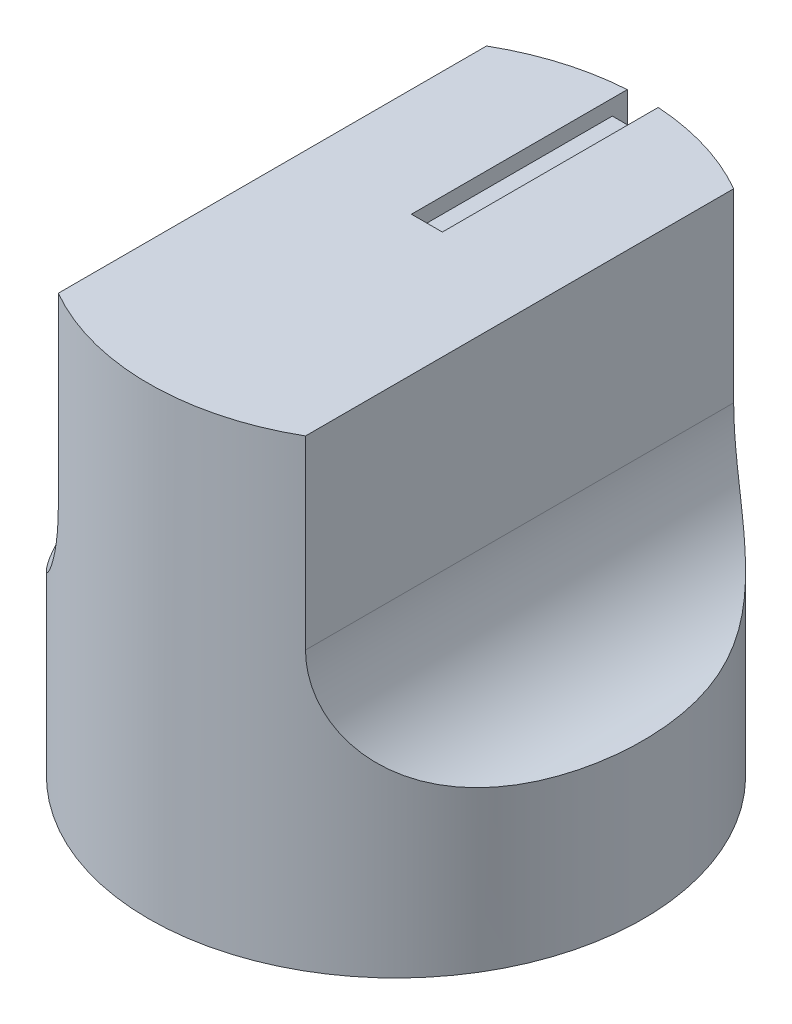
ISO-10303-21;
HEADER;
FILE_DESCRIPTION(('STEP AP214'),'2;1');
FILE_NAME('part.step','',(''),(''),'','','');
FILE_SCHEMA(('AUTOMOTIVE_DESIGN { 1 0 10303 214 1 1 1 1 }'));
ENDSEC;
DATA;
#1=APPLICATION_CONTEXT('core data for automotive mechanical design processes');
#2=APPLICATION_PROTOCOL_DEFINITION('international standard','automotive_design',2000,#1);
#3=PRODUCT_CONTEXT('',#1,'mechanical');
#4=PRODUCT('Part','Part','',(#3));
#5=PRODUCT_RELATED_PRODUCT_CATEGORY('part','',(#4));
#6=PRODUCT_DEFINITION_FORMATION('','',#4);
#7=PRODUCT_DEFINITION_CONTEXT('part definition',#1,'design');
#8=PRODUCT_DEFINITION('design','',#6,#7);
#9=PRODUCT_DEFINITION_SHAPE('','',#8);
#10=(LENGTH_UNIT() NAMED_UNIT(*) SI_UNIT(.MILLI.,.METRE.));
#11=(NAMED_UNIT(*) PLANE_ANGLE_UNIT() SI_UNIT($,.RADIAN.));
#12=(NAMED_UNIT(*) SI_UNIT($,.STERADIAN.) SOLID_ANGLE_UNIT());
#13=UNCERTAINTY_MEASURE_WITH_UNIT(LENGTH_MEASURE(1.E-05),#10,'distance_accuracy_value','');
#14=(GEOMETRIC_REPRESENTATION_CONTEXT(3) GLOBAL_UNCERTAINTY_ASSIGNED_CONTEXT((#13)) GLOBAL_UNIT_ASSIGNED_CONTEXT((#10,
#11,#12)) REPRESENTATION_CONTEXT('',''));
#15=CARTESIAN_POINT('',(0.,0.,0.));
#16=DIRECTION('',(0.,0.,1.));
#17=DIRECTION('',(1.,0.,0.));
#18=AXIS2_PLACEMENT_3D('',#15,#16,#17);
#19=CARTESIAN_POINT('',(0.,3.,0.));
#20=DIRECTION('',(0.,-1.,0.));
#21=DIRECTION('',(0.,0.,-1.));
#22=AXIS2_PLACEMENT_3D('',#19,#20,#21);
#23=CYLINDRICAL_SURFACE('',#22,6.45);
#24=CARTESIAN_POINT('',(0.,3.,0.));
#25=DIRECTION('',(0.,-1.,0.));
#26=DIRECTION('',(0.,0.,-1.));
#27=AXIS2_PLACEMENT_3D('',#24,#25,#26);
#28=CIRCLE('',#27,6.45);
#29=CARTESIAN_POINT('',(0.,3.,-6.45));
#30=VERTEX_POINT('',#29);
#31=EDGE_CURVE('E11',#30,#30,#28,.T.);
#32=ORIENTED_EDGE('',*,*,#31,.T.);
#33=EDGE_LOOP('',(#32));
#34=FACE_BOUND('',#33,.T.);
#35=CARTESIAN_POINT('',(0.,0.,0.));
#36=DIRECTION('',(0.,-1.,0.));
#37=DIRECTION('',(0.,0.,-1.));
#38=AXIS2_PLACEMENT_3D('',#35,#36,#37);
#39=CIRCLE('',#38,6.45);
#40=CARTESIAN_POINT('',(0.,0.,-6.45));
#41=VERTEX_POINT('',#40);
#42=EDGE_CURVE('E44',#41,#41,#39,.T.);
#43=ORIENTED_EDGE('',*,*,#42,.F.);
#44=EDGE_LOOP('',(#43));
#45=FACE_BOUND('',#44,.T.);
#46=ADVANCED_FACE('F41',(#34,#45),#23,.T.);
#47=CARTESIAN_POINT('',(0.,3.,0.));
#48=DIRECTION('',(0.,-1.,0.));
#49=DIRECTION('',(0.,0.,-1.));
#50=AXIS2_PLACEMENT_3D('',#47,#48,#49);
#51=PLANE('',#50);
#52=CARTESIAN_POINT('',(0.,3.,0.));
#53=DIRECTION('',(0.,-1.,0.));
#54=DIRECTION('',(0.,0.,-1.));
#55=AXIS2_PLACEMENT_3D('',#52,#53,#54);
#56=CIRCLE('',#55,3.8);
#57=CARTESIAN_POINT('',(0.,3.,-3.8));
#58=VERTEX_POINT('',#57);
#59=EDGE_CURVE('E51',#58,#58,#56,.T.);
#60=ORIENTED_EDGE('',*,*,#59,.T.);
#61=EDGE_LOOP('',(#60));
#62=FACE_BOUND('',#61,.T.);
#63=ORIENTED_EDGE('',*,*,#31,.F.);
#64=EDGE_LOOP('',(#63));
#65=FACE_BOUND('',#64,.T.);
#66=ADVANCED_FACE('F59',(#62,#65),#51,.F.);
#67=CARTESIAN_POINT('',(0.,0.,0.));
#68=DIRECTION('',(0.,-1.,0.));
#69=DIRECTION('',(0.,0.,-1.));
#70=AXIS2_PLACEMENT_3D('',#67,#68,#69);
#71=PLANE('',#70);
#72=CARTESIAN_POINT('',(0.,0.,0.));
#73=DIRECTION('',(0.,-1.,0.));
#74=DIRECTION('',(0.,0.,-1.));
#75=AXIS2_PLACEMENT_3D('',#72,#73,#74);
#76=CIRCLE('',#75,3.8);
#77=CARTESIAN_POINT('',(0.,0.,-3.8));
#78=VERTEX_POINT('',#77);
#79=EDGE_CURVE('E53',#78,#78,#76,.T.);
#80=ORIENTED_EDGE('',*,*,#79,.F.);
#81=EDGE_LOOP('',(#80));
#82=FACE_BOUND('',#81,.T.);
#83=ORIENTED_EDGE('',*,*,#42,.T.);
#84=EDGE_LOOP('',(#83));
#85=FACE_BOUND('',#84,.T.);
#86=ADVANCED_FACE('F65',(#82,#85),#71,.T.);
#87=CARTESIAN_POINT('',(0.,3.,0.));
#88=DIRECTION('',(0.,-1.,0.));
#89=DIRECTION('',(0.,0.,-1.));
#90=AXIS2_PLACEMENT_3D('',#87,#88,#89);
#91=CYLINDRICAL_SURFACE('',#90,3.8);
#92=ORIENTED_EDGE('',*,*,#59,.F.);
#93=EDGE_LOOP('',(#92));
#94=FACE_BOUND('',#93,.T.);
#95=ORIENTED_EDGE('',*,*,#79,.T.);
#96=EDGE_LOOP('',(#95));
#97=FACE_BOUND('',#96,.T.);
#98=ADVANCED_FACE('F62',(#94,#97),#91,.F.);
#99=CLOSED_SHELL('',(#46,#66,#86,#98));
#100=MANIFOLD_SOLID_BREP('B2',#99);
#101=CARTESIAN_POINT('',(0.,15.,0.));
#102=DIRECTION('',(0.,-1.,0.));
#103=DIRECTION('',(0.,0.,-1.));
#104=AXIS2_PLACEMENT_3D('',#101,#102,#103);
#105=CYLINDRICAL_SURFACE('',#104,8.);
#106=CARTESIAN_POINT('',(0.,0.,0.));
#107=DIRECTION('',(0.,1.,0.));
#108=DIRECTION('',(0.,0.,1.));
#109=AXIS2_PLACEMENT_3D('',#106,#107,#108);
#110=CIRCLE('',#109,8.);
#111=CARTESIAN_POINT('',(-0.5,0.,-7.98435971133565));
#112=VERTEX_POINT('',#111);
#113=CARTESIAN_POINT('',(0.5,0.,-7.98435971133565));
#114=VERTEX_POINT('',#113);
#115=EDGE_CURVE('E250',#112,#114,#110,.T.);
#116=ORIENTED_EDGE('',*,*,#115,.T.);
#117=DIRECTION('',(0.,-1.,0.));
#118=VECTOR('',#117,1.);
#119=CARTESIAN_POINT('',(0.5,15.,-7.98435971133565));
#120=LINE('',#119,#118);
#121=CARTESIAN_POINT('',(0.5,15.,-7.98435971133565));
#122=VERTEX_POINT('',#121);
#123=EDGE_CURVE('E111',#114,#122,#120,.F.);
#124=ORIENTED_EDGE('',*,*,#123,.T.);
#125=CARTESIAN_POINT('',(0.,15.,0.));
#126=DIRECTION('',(0.,1.,0.));
#127=DIRECTION('',(0.,0.,1.));
#128=AXIS2_PLACEMENT_3D('',#125,#126,#127);
#129=CIRCLE('',#128,8.);
#130=CARTESIAN_POINT('',(4.,15.,-6.92820323027551));
#131=VERTEX_POINT('',#130);
#132=EDGE_CURVE('E255',#131,#122,#129,.T.);
#133=ORIENTED_EDGE('',*,*,#132,.F.);
#134=DIRECTION('',(0.,-1.,0.));
#135=VECTOR('',#134,1.);
#136=CARTESIAN_POINT('',(4.,15.,-6.92820323027551));
#137=LINE('',#136,#135);
#138=CARTESIAN_POINT('',(4.,9.,-6.92820323027551));
#139=VERTEX_POINT('',#138);
#140=EDGE_CURVE('E243',#131,#139,#137,.T.);
#141=ORIENTED_EDGE('',*,*,#140,.T.);
#142=CARTESIAN_POINT('',(4.,9.,-6.92820323027551));
#143=CARTESIAN_POINT('',(3.9999835722425,8.90200515013691,-6.92819687410735));
#144=CARTESIAN_POINT('',(4.00360043340264,8.80401188244841,-6.9261240227385));
#145=CARTESIAN_POINT('',(4.01798276798626,8.60873570848839,-6.91779893875372));
#146=CARTESIAN_POINT('',(4.02874781000819,8.51145275970643,-6.91154695835323));
#147=CARTESIAN_POINT('',(4.05728899691143,8.31842478046616,-6.8948286993831));
#148=CARTESIAN_POINT('',(4.07505551335688,8.22267782510478,-6.88436820795136));
#149=CARTESIAN_POINT('',(4.11736554168773,8.03327199832824,-6.85914798190404));
#150=CARTESIAN_POINT('',(4.14190895354734,7.93961309611583,-6.84438831074345));
#151=CARTESIAN_POINT('',(4.19746101487635,7.75501328537845,-6.8104609571265));
#152=CARTESIAN_POINT('',(4.22847203616782,7.66407338800315,-6.79129165729093));
#153=CARTESIAN_POINT('',(4.29654650358197,7.48554906331703,-6.74842986488926));
#154=CARTESIAN_POINT('',(4.33361216584693,7.39796587918973,-6.7247357155819));
#155=CARTESIAN_POINT('',(4.41324580286913,7.22684069241129,-6.6727444832938));
#156=CARTESIAN_POINT('',(4.45580978785766,7.14329581924895,-6.64445073412743));
#157=CARTESIAN_POINT('',(4.54587613481682,6.98067527510326,-6.58315867012874));
#158=CARTESIAN_POINT('',(4.5933803104103,6.90160126200629,-6.55015862587755));
#159=CARTESIAN_POINT('',(4.69290796413624,6.74798783046527,-6.4792254778006));
#160=CARTESIAN_POINT('',(4.74495423874842,6.67347490575537,-6.44126695188476));
#161=CARTESIAN_POINT('',(4.852602391186,6.52978464844852,-6.36056521178928));
#162=CARTESIAN_POINT('',(4.90820553628836,6.46060923713861,-6.31782028814789));
#163=CARTESIAN_POINT('',(5.07916803374714,6.26152367084069,-6.18248162788317));
#164=CARTESIAN_POINT('',(5.19875091452228,6.13994785248332,-6.0827351957496));
#165=CARTESIAN_POINT('',(5.45018821795654,5.91309823520741,-5.8587972011498));
#166=CARTESIAN_POINT('',(5.58234444563209,5.80929448274484,-5.73347656075242));
#167=CARTESIAN_POINT('',(5.84541736244444,5.62605488345185,-5.46501709005642));
#168=CARTESIAN_POINT('',(5.97633345512774,5.54663023729272,-5.32187011200171));
#169=CARTESIAN_POINT('',(6.19989900396769,5.42627315003248,-5.05800022202342));
#170=CARTESIAN_POINT('',(6.29397602939143,5.38067994937706,-4.94053971650036));
#171=CARTESIAN_POINT('',(6.47692504289753,5.29996761174969,-4.69813684152143));
#172=CARTESIAN_POINT('',(6.56579488818492,5.26485276270943,-4.5731914341527));
#173=CARTESIAN_POINT('',(6.7372577248798,5.20344923127442,-4.31662247507116));
#174=CARTESIAN_POINT('',(6.81983688297195,5.17717958940873,-4.18498520999598));
#175=CARTESIAN_POINT('',(6.97767616680622,5.13197837366049,-3.91616493360132));
#176=CARTESIAN_POINT('',(7.05293434827596,5.11304874514201,-3.77898046269936));
#177=CARTESIAN_POINT('',(7.21967322379826,5.07563008091141,-3.45258095752635));
#178=CARTESIAN_POINT('',(7.30800946701544,5.0594639629425,-3.26148721369789));
#179=CARTESIAN_POINT('',(7.46948016307689,5.03449604217453,-2.87250009121431));
#180=CARTESIAN_POINT('',(7.54260970618666,5.02569661506718,-2.6746045404403));
#181=CARTESIAN_POINT('',(7.67304641667369,5.01284593772434,-2.27350709522336));
#182=CARTESIAN_POINT('',(7.73035210338644,5.0087951317102,-2.07030470615671));
#183=CARTESIAN_POINT('',(7.8287230023349,5.00336503278157,-1.66000115984097));
#184=CARTESIAN_POINT('',(7.86978974461307,5.00198548813159,-1.45290037182838));
#185=CARTESIAN_POINT('',(7.93589866811422,5.00037465285776,-1.0331050430258));
#186=CARTESIAN_POINT('',(7.96070244115308,5.00016012370093,-0.82037287857853));
#187=CARTESIAN_POINT('',(7.99317690069333,4.99997282201595,-0.393601563439323));
#188=CARTESIAN_POINT('',(8.00084723416683,5.00000005446914,-0.179562385908006));
#189=CARTESIAN_POINT('',(7.99900409932795,4.99999994600007,0.248535668334523));
#190=CARTESIAN_POINT('',(7.98948318837758,4.99997258144049,0.462594513439574));
#191=CARTESIAN_POINT('',(7.95330499069097,5.00023199564045,0.889257947956167));
#192=CARTESIAN_POINT('',(7.92664758786675,5.00051877652814,1.1018625275062));
#193=CARTESIAN_POINT('',(7.85453693676795,5.0024740538076,1.53524548879987));
#194=CARTESIAN_POINT('',(7.80817778657693,5.00421367453819,1.75587350364351));
#195=CARTESIAN_POINT('',(7.69701030356687,5.01110341546063,2.19243528479369));
#196=CARTESIAN_POINT('',(7.63219829929158,5.01625421462539,2.40836810771346));
#197=CARTESIAN_POINT('',(7.4847372971087,5.03263282779193,2.83360272537685));
#198=CARTESIAN_POINT('',(7.40210551417363,5.04385479236036,3.04291069788407));
#199=CARTESIAN_POINT('',(7.2198176518114,5.07573251191517,3.45319298052435));
#200=CARTESIAN_POINT('',(7.12017065331112,5.09638324460983,3.65417166521782));
#201=CARTESIAN_POINT('',(6.94246644788377,5.14165062466312,3.97787745786033));
#202=CARTESIAN_POINT('',(6.86887366443633,5.16242085718355,4.10361263117451));
#203=CARTESIAN_POINT('',(6.71560401472481,5.21096443384684,4.34990534633432));
#204=CARTESIAN_POINT('',(6.63592882679414,5.23873585096963,4.47046430222393));
#205=CARTESIAN_POINT('',(6.4714163821079,5.30254118291035,4.70545535859407));
#206=CARTESIAN_POINT('',(6.38658755489698,5.33856185864803,4.81989691765251));
#207=CARTESIAN_POINT('',(6.21274572706049,5.4202044149101,5.04198935516655));
#208=CARTESIAN_POINT('',(6.12373363032192,5.46582422867077,5.14964168891702));
#209=CARTESIAN_POINT('',(5.96163169971906,5.55735020283785,5.33581223429792));
#210=CARTESIAN_POINT('',(5.88904755187229,5.60125377643106,5.41575760634648));
#211=CARTESIAN_POINT('',(5.74304972581093,5.6964014240122,5.57033873976989));
#212=CARTESIAN_POINT('',(5.6696362275839,5.74764393244294,5.64497562849256));
#213=CARTESIAN_POINT('',(5.52301366733616,5.85787524674273,5.78850976877604));
#214=CARTESIAN_POINT('',(5.44980458320885,5.91686317899093,5.85740766621815));
#215=CARTESIAN_POINT('',(5.30475134112474,6.04282917569553,5.98909084055749));
#216=CARTESIAN_POINT('',(5.23290719650679,6.1098073181896,6.05187605774336));
#217=CARTESIAN_POINT('',(5.09131854481067,6.25232188729707,6.17147713837903));
#218=CARTESIAN_POINT('',(5.02159394973688,6.3279190267428,6.22824443153859));
#219=CARTESIAN_POINT('',(4.8861625366048,6.48704780335284,6.33504977878511));
#220=CARTESIAN_POINT('',(4.82045530748055,6.57057862648387,6.38508852198298));
#221=CARTESIAN_POINT('',(4.69437261082681,6.74513454723132,6.47834996407541));
#222=CARTESIAN_POINT('',(4.63399688188037,6.83615927697917,6.52157299724322));
#223=CARTESIAN_POINT('',(4.51981351149139,7.02503801310311,6.60122225704981));
#224=CARTESIAN_POINT('',(4.46600489466706,7.12289100190888,6.63764949346169));
#225=CARTESIAN_POINT('',(4.37229876928447,7.31195794770743,6.699683224821));
#226=CARTESIAN_POINT('',(4.33150311480748,7.40247216656111,6.72607320068346));
#227=CARTESIAN_POINT('',(4.25639507181425,7.58742040868101,6.77385290061837));
#228=CARTESIAN_POINT('',(4.22208206778328,7.68185405876557,6.79524309945546));
#229=CARTESIAN_POINT('',(4.16047772400686,7.87384549289628,6.83313506277601));
#230=CARTESIAN_POINT('',(4.13318043533467,7.9714005506986,6.84964097066958));
#231=CARTESIAN_POINT('',(4.08597229460042,8.16891782100564,6.87790536535641));
#232=CARTESIAN_POINT('',(4.06605885415348,8.26887917687969,6.88966551588799));
#233=CARTESIAN_POINT('',(4.03338629630058,8.47364611500904,6.9088485348705));
#234=CARTESIAN_POINT('',(4.0208730611694,8.57850497125034,6.91612264975934));
#235=CARTESIAN_POINT('',(4.00417639291733,8.78891013511775,6.92579129141725));
#236=CARTESIAN_POINT('',(3.99997752893938,8.89445480382254,6.92819485775773));
#237=CARTESIAN_POINT('',(4.,9.,6.92820323027551));
#238=B_SPLINE_CURVE_WITH_KNOTS('',3,(#142,#143,#144,#145,#146,#147,#148,#149,#150,#151,#152,
#153,#154,#155,#156,#157,#158,#159,#160,#161,#162,#163,#164,#165,#166,#167,#168,#169,#170,#171,
#172,#173,#174,#175,#176,#177,#178,#179,#180,#181,#182,#183,#184,#185,#186,#187,#188,#189,#190,
#191,#192,#193,#194,#195,#196,#197,#198,#199,#200,#201,#202,#203,#204,#205,#206,#207,#208,#209,
#210,#211,#212,#213,#214,#215,#216,#217,#218,#219,#220,#221,#222,#223,#224,#225,#226,#227,#228,
#229,#230,#231,#232,#233,#234,#235,#236,#237),.UNSPECIFIED.,.F.,.F.,(4,2,2,2,2,2,2,2,2,2,2,2,2,
2,2,2,2,2,2,2,2,2,2,2,2,2,2,2,2,2,2,2,2,2,2,2,2,2,2,2,2,2,2,2,2,2,2,4),(0.,0.293893692414347,
0.587769649592562,0.881242870651832,1.17471176032868,1.46828846167718,1.76197286084344,
2.05544533736351,2.34902593521375,2.64417557174289,2.93943095920887,3.52953675069302,
4.15607819353379,4.78290706351439,5.25403152085577,5.72534850731815,6.1976736774062,
6.67012394500356,7.30266881905536,7.93541760465959,8.5682255775702,9.20097391274415,
9.84280215588045,10.4846436235174,11.1267630314244,11.7688867892965,12.4444250112155,
13.1200977350561,13.7951206195504,14.4697843676346,14.9109411024683,15.3519765447573,
15.7923090770895,16.2325468994819,16.5819187832327,16.9312162489325,17.2804743505065,
17.629735863446,17.9816304003067,18.3334888700564,18.685330077704,19.0371189642967,
19.3449211343937,19.6526940645851,19.9602051533862,20.2676083429987,20.5847225831056,
20.9012477289834),.UNSPECIFIED.);
#239=CARTESIAN_POINT('',(4.,9.,6.92820323027551));
#240=VERTEX_POINT('',#239);
#241=EDGE_CURVE('E262',#139,#240,#238,.T.);
#242=ORIENTED_EDGE('',*,*,#241,.T.);
#243=DIRECTION('',(0.,-1.,0.));
#244=VECTOR('',#243,1.);
#245=CARTESIAN_POINT('',(4.,15.,6.92820323027551));
#246=LINE('',#245,#244);
#247=CARTESIAN_POINT('',(4.,15.,6.92820323027551));
#248=VERTEX_POINT('',#247);
#249=EDGE_CURVE('E238',#240,#248,#246,.F.);
#250=ORIENTED_EDGE('',*,*,#249,.T.);
#251=CARTESIAN_POINT('',(-4.,15.,6.92820323027551));
#252=VERTEX_POINT('',#251);
#253=EDGE_CURVE('E251',#252,#248,#129,.T.);
#254=ORIENTED_EDGE('',*,*,#253,.F.);
#255=DIRECTION('',(0.,-1.,0.));
#256=VECTOR('',#255,1.);
#257=CARTESIAN_POINT('',(-4.,15.,6.92820323027551));
#258=LINE('',#257,#256);
#259=CARTESIAN_POINT('',(-4.,9.,6.92820323027551));
#260=VERTEX_POINT('',#259);
#261=EDGE_CURVE('E126',#252,#260,#258,.T.);
#262=ORIENTED_EDGE('',*,*,#261,.T.);
#263=CARTESIAN_POINT('',(-4.,9.,-6.92820323027551));
#264=CARTESIAN_POINT('',(-4.00000070990149,9.09776602355344,-6.92820330287687));
#265=CARTESIAN_POINT('',(-4.00358933509886,9.1955573585385,-6.92613477111611));
#266=CARTESIAN_POINT('',(-4.01790451974824,9.39047992600172,-6.91783995927107));
#267=CARTESIAN_POINT('',(-4.02863504847643,9.48761076104948,-6.91161136713138));
#268=CARTESIAN_POINT('',(-4.05712783924524,9.6806575971894,-6.8949247127317));
#269=CARTESIAN_POINT('',(-4.07490316094188,9.77657099865334,-6.88445879452402));
#270=CARTESIAN_POINT('',(-4.11726365035122,9.96634061672385,-6.85920894508524));
#271=CARTESIAN_POINT('',(-4.14185140886115,10.060196035988,-6.84442337095482));
#272=CARTESIAN_POINT('',(-4.19746597192239,10.2450028340334,-6.81045801367739));
#273=CARTESIAN_POINT('',(-4.2284829121503,10.3359584182188,-6.79128495763171));
#274=CARTESIAN_POINT('',(-4.29657133982773,10.5145127823699,-6.74841407897512));
#275=CARTESIAN_POINT('',(-4.33364504247477,10.6021103196382,-6.72471460033428));
#276=CARTESIAN_POINT('',(-4.41328255074227,10.7732327255928,-6.67272014456763));
#277=CARTESIAN_POINT('',(-4.45584043662692,10.8567618537531,-6.64443011416129));
#278=CARTESIAN_POINT('',(-4.54589274893096,11.0193523855586,-6.5831471265146));
#279=CARTESIAN_POINT('',(-4.59338898767261,11.0984121324409,-6.55015244105506));
#280=CARTESIAN_POINT('',(-4.69290956944701,11.2520146454543,-6.47922433425811));
#281=CARTESIAN_POINT('',(-4.74495759102087,11.326529892858,-6.44126450718063));
#282=CARTESIAN_POINT('',(-4.85260944400998,11.4702244410966,-6.36055985576731));
#283=CARTESIAN_POINT('',(-4.90821454297109,11.5394018202184,-6.31781332159535));
#284=CARTESIAN_POINT('',(-5.07917574833982,11.7384841797498,-6.18247519640123));
#285=CARTESIAN_POINT('',(-5.19875484613128,11.8600556964283,-6.0827316935506));
#286=CARTESIAN_POINT('',(-5.45018504864899,12.0868989035289,-5.85880002445516));
#287=CARTESIAN_POINT('',(-5.58233798096011,12.1907004412388,-5.73348269799996));
#288=CARTESIAN_POINT('',(-5.84541095448471,12.3739412271099,-5.46502408895546));
#289=CARTESIAN_POINT('',(-5.97633033585862,12.4533680826962,-5.3218737915539));
#290=CARTESIAN_POINT('',(-6.19989989841727,12.5737273320564,-5.05799916786946));
#291=CARTESIAN_POINT('',(-6.29397777861536,12.6193208986644,-4.94053753275898));
#292=CARTESIAN_POINT('',(-6.47692839150713,12.7000337892319,-4.69813227081212));
#293=CARTESIAN_POINT('',(-6.56579898148471,12.7351488254334,-4.57318560618431));
#294=CARTESIAN_POINT('',(-6.73726158001414,12.796552026693,-4.31661640855879));
#295=CARTESIAN_POINT('',(-6.81983987502246,12.8228213162013,-4.18498028101974));
#296=CARTESIAN_POINT('',(-6.97767756144808,12.8680219769797,-3.9161623913565));
#297=CARTESIAN_POINT('',(-7.05293500875471,12.8869514030528,-3.77897916977416));
#298=CARTESIAN_POINT('',(-7.21967304702145,12.9243698794525,-3.45258130358329));
#299=CARTESIAN_POINT('',(-7.30800914010969,12.9405359771436,-3.26148792098286));
#300=CARTESIAN_POINT('',(-7.46947959456335,12.9655038792807,-2.87250154109829));
#301=CARTESIAN_POINT('',(-7.54260904602782,12.9743033079526,-2.67460637162059));
#302=CARTESIAN_POINT('',(-7.67304587352829,12.9871540207962,-2.27350896426308));
#303=CARTESIAN_POINT('',(-7.73035171063053,12.9912048432641,-2.07030621229374));
#304=CARTESIAN_POINT('',(-7.82872285089215,12.9966349622046,-1.66000192355134));
#305=CARTESIAN_POINT('',(-7.86978968410734,12.9980145104152,-1.45290075601823));
#306=CARTESIAN_POINT('',(-7.93589867463977,12.9996253472799,-1.03310500161348));
#307=CARTESIAN_POINT('',(-7.96070245085685,12.999839876372,-0.820372795362573));
#308=CARTESIAN_POINT('',(-7.99317691001474,13.0000271780208,-0.393601396628912));
#309=CARTESIAN_POINT('',(-8.00084723995513,12.9999999455964,-0.179562177308864));
#310=CARTESIAN_POINT('',(-7.99900409174175,13.0000000540503,0.248535876692019));
#311=CARTESIAN_POINT('',(-7.98948317762883,13.0000274185445,0.462594679794784));
#312=CARTESIAN_POINT('',(-7.95330498032008,12.9997680042235,0.889258030671059));
#313=CARTESIAN_POINT('',(-7.92664758103239,12.9994812232801,1.10186256858273));
#314=CARTESIAN_POINT('',(-7.8545369374175,12.9975259462168,1.53524548489373));
#315=CARTESIAN_POINT('',(-7.80817778820372,12.9957863255236,1.75587349590159));
#316=CARTESIAN_POINT('',(-7.69701030779563,12.9888965848404,2.19243526954058));
#317=CARTESIAN_POINT('',(-7.63219830514726,12.9837457858778,2.4083680887855));
#318=CARTESIAN_POINT('',(-7.48473730429051,12.9673671731528,2.83360270670667));
#319=CARTESIAN_POINT('',(-7.40210552043905,12.9561452086145,3.04291068292555));
#320=CARTESIAN_POINT('',(-7.21981765548318,12.9242674888477,3.45319297311545));
#321=CARTESIAN_POINT('',(-7.12017065527741,12.9036167558951,3.65417166163323));
#322=CARTESIAN_POINT('',(-6.94246647686326,12.8583493827163,3.97787740507314));
#323=CARTESIAN_POINT('',(-6.8688737251568,12.8375791599449,4.10361252743341));
#324=CARTESIAN_POINT('',(-6.71560411070063,12.7890355986533,4.3499051982693));
#325=CARTESIAN_POINT('',(-6.63592892365583,12.7612641841349,4.47046415857415));
#326=CARTESIAN_POINT('',(-6.4714164675322,12.6974588526793,4.70545524185686));
#327=CARTESIAN_POINT('',(-6.38658762719628,12.6614381735612,4.81989682251143));
#328=CARTESIAN_POINT('',(-6.21274576716995,12.5797956056705,5.04198930669649));
#329=CARTESIAN_POINT('',(-6.12373365113981,12.5341757831431,5.14964166515694));
#330=CARTESIAN_POINT('',(-5.96163113307115,12.4426494771741,5.33581288496264));
#331=CARTESIAN_POINT('',(-5.88904640441823,12.398745529412,5.41575886983283));
#332=CARTESIAN_POINT('',(-5.74304943524137,12.3035983330251,5.5703389988925));
#333=CARTESIAN_POINT('',(-5.66963739810161,12.2523568534861,5.64497441699048));
#334=CARTESIAN_POINT('',(-5.52301589536435,12.1421265223312,5.78850765331924));
#335=CARTESIAN_POINT('',(-5.44980641259024,12.0831383495611,5.85740597343075));
#336=CARTESIAN_POINT('',(-5.30475228736507,11.9571717061189,5.98909001356301));
#337=CARTESIAN_POINT('',(-5.23290765997551,11.8901931473304,6.05187566616055));
#338=CARTESIAN_POINT('',(-5.09131824840415,11.747677815345,6.1714773888437));
#339=CARTESIAN_POINT('',(-5.02159337010758,11.6720803481191,6.22824490361441));
#340=CARTESIAN_POINT('',(-4.88615278633931,11.5129406842463,6.33505745289827));
#341=CARTESIAN_POINT('',(-4.82043718083188,11.4293982896392,6.38510231983118));
#342=CARTESIAN_POINT('',(-4.69435260749895,11.2548357471545,6.47836437006798));
#343=CARTESIAN_POINT('',(-4.63398225596499,11.1638175463442,6.521583322658));
#344=CARTESIAN_POINT('',(-4.51980739369818,10.9749508501995,6.60122640137803));
#345=CARTESIAN_POINT('',(-4.46600205313775,10.8771032205785,6.63765138658443));
#346=CARTESIAN_POINT('',(-4.37232722685247,10.6880995086601,6.69966437531455));
#347=CARTESIAN_POINT('',(-4.331556214559,10.5976457795977,6.72603881377807));
#348=CARTESIAN_POINT('',(-4.25647234687928,10.4127826606064,6.77380434945974));
#349=CARTESIAN_POINT('',(-4.22216169807527,10.3183719325495,6.79519374459254));
#350=CARTESIAN_POINT('',(-4.16054936567877,10.1263998903568,6.83309137336605));
#351=CARTESIAN_POINT('',(-4.13324376208968,10.0288403728362,6.84960233774637));
#352=CARTESIAN_POINT('',(-4.08600425338262,9.83123988245688,6.87788694704262));
#353=CARTESIAN_POINT('',(-4.06607304636665,9.73119801562722,6.88965885819933));
#354=CARTESIAN_POINT('',(-4.03462726640266,9.53414255719846,6.90811832761766));
#355=CARTESIAN_POINT('',(-4.02276497517198,9.43720393271993,6.9150165147));
#356=CARTESIAN_POINT('',(-4.00616022966299,9.24247732396191,6.92464966830118));
#357=CARTESIAN_POINT('',(-4.00142030353541,9.14468905047344,6.92738315652564));
#358=CARTESIAN_POINT('',(-3.99912887019422,8.94904717503638,6.92870622523126));
#359=CARTESIAN_POINT('',(-4.00157395297401,8.85119362610691,6.92729777147863));
#360=CARTESIAN_POINT('',(-4.01361664384383,8.65603990182341,6.92032728474647));
#361=CARTESIAN_POINT('',(-4.0232168838967,8.55873994337697,6.91476372334489));
#362=CARTESIAN_POINT('',(-4.04938887621379,8.36588998904652,6.89946938070487));
#363=CARTESIAN_POINT('',(-4.0659271297297,8.27033385665036,6.8897586193481));
#364=CARTESIAN_POINT('',(-4.10576759414658,8.08114058850231,6.86609123955536));
#365=CARTESIAN_POINT('',(-4.1290722692108,7.98750416518483,6.85213307423088));
#366=CARTESIAN_POINT('',(-4.1821277162462,7.80289081601536,6.81988048643909));
#367=CARTESIAN_POINT('',(-4.21187538850573,7.71191263509274,6.80158814873623));
#368=CARTESIAN_POINT('',(-4.27743764138413,7.53316790340114,6.76054900887817));
#369=CARTESIAN_POINT('',(-4.31325443820581,7.44540254011278,6.7378005790603));
#370=CARTESIAN_POINT('',(-4.39053601883212,7.27354178900328,6.68769872909116));
#371=CARTESIAN_POINT('',(-4.43201125264578,7.18945358074779,6.66033676607349));
#372=CARTESIAN_POINT('',(-4.51997420512893,7.02564337868167,6.60095865970766));
#373=CARTESIAN_POINT('',(-4.56646373204203,6.94592297571281,6.56894083591391));
#374=CARTESIAN_POINT('',(-4.71245380462405,6.71411629405484,6.46582761165787));
#375=CARTESIAN_POINT('',(-4.81856222471656,6.56919624706261,6.38761853067557));
#376=CARTESIAN_POINT('',(-5.04526632313501,6.29782934387071,6.21019472491874));
#377=CARTESIAN_POINT('',(-5.16617377792645,6.17198084964538,6.11047373896566));
#378=CARTESIAN_POINT('',(-5.41354621000537,5.9440948986103,5.89242278357558));
#379=CARTESIAN_POINT('',(-5.5400132673066,5.84206644524849,5.77408580590254));
#380=CARTESIAN_POINT('',(-5.75188083151402,5.68984375722648,5.56153650431224));
#381=CARTESIAN_POINT('',(-5.83744627515575,5.63351913601008,5.4717558046432));
#382=CARTESIAN_POINT('',(-6.00684827778962,5.53053819026654,5.28522734732031));
#383=CARTESIAN_POINT('',(-6.0906843235827,5.4838846995148,5.18847755878502));
#384=CARTESIAN_POINT('',(-6.2554328317939,5.39929436669955,4.98862376024073));
#385=CARTESIAN_POINT('',(-6.3363404507889,5.36137145475002,4.88550992387976));
#386=CARTESIAN_POINT('',(-6.49410950578001,5.293293118875,4.67375542023035));
#387=CARTESIAN_POINT('',(-6.57096981229405,5.26313985417757,4.565113226604));
#388=CARTESIAN_POINT('',(-6.74744089466729,5.1996229335774,4.30181256800476));
#389=CARTESIAN_POINT('',(-6.84493209019776,5.16920785268356,4.14501639473949));
#390=CARTESIAN_POINT('',(-7.02942498943289,5.11835788906532,3.82381135200353));
#391=CARTESIAN_POINT('',(-7.11642269353054,5.09792680275589,3.65939961268846));
#392=CARTESIAN_POINT('',(-7.27906552352811,5.06462833656944,3.3241466946258));
#393=CARTESIAN_POINT('',(-7.35469988456443,5.05176809556693,3.1532996086741));
#394=CARTESIAN_POINT('',(-7.49390247201554,5.03152277329121,2.80648294229948));
#395=CARTESIAN_POINT('',(-7.55747174676512,5.02413721616081,2.6305138084649));
#396=CARTESIAN_POINT('',(-7.67390606501344,5.01287193912906,2.268992583558));
#397=CARTESIAN_POINT('',(-7.72638299041423,5.00910669669513,2.0833121102635));
#398=CARTESIAN_POINT('',(-7.81778832716794,5.00389009728358,1.70861853912417));
#399=CARTESIAN_POINT('',(-7.85671654776933,5.00243877288245,1.51960539439818));
#400=CARTESIAN_POINT('',(-7.92080166377113,5.00065545973171,1.13932655115621));
#401=CARTESIAN_POINT('',(-7.94596373247855,5.00032305025259,0.948061726460444));
#402=CARTESIAN_POINT('',(-7.98240830748772,4.9999976164897,0.564209465191368));
#403=CARTESIAN_POINT('',(-7.99369002282592,5.00000461154577,0.371621953874336));
#404=CARTESIAN_POINT('',(-8.00299349065673,4.99999573656709,-0.0444410341855977));
#405=CARTESIAN_POINT('',(-7.99862997793694,4.99997606647677,-0.267973772760683));
#406=CARTESIAN_POINT('',(-7.97121316822046,5.00008077348956,-0.713917203824179));
#407=CARTESIAN_POINT('',(-7.94815699616058,5.00020517275281,-0.936327718411184));
#408=CARTESIAN_POINT('',(-7.88349029772063,5.00156643809818,-1.37861158838073));
#409=CARTESIAN_POINT('',(-7.84186518324387,5.00280417962064,-1.59848280924918));
#410=CARTESIAN_POINT('',(-7.74035856292256,5.00811183013009,-2.03391352517529));
#411=CARTESIAN_POINT('',(-7.68048034380136,5.0121812294071,-2.24947378904006));
#412=CARTESIAN_POINT('',(-7.55404541284902,5.0245167436503,-2.6403646322207));
#413=CARTESIAN_POINT('',(-7.49012393540432,5.03200003069208,-2.81657576613666));
#414=CARTESIAN_POINT('',(-7.35018419159859,5.05250157940943,-3.16383013104305));
#415=CARTESIAN_POINT('',(-7.27416566023942,5.06551996234729,-3.3348732487252));
#416=CARTESIAN_POINT('',(-7.11079027156441,5.09919876132549,-3.67034216097596));
#417=CARTESIAN_POINT('',(-7.02345269983747,5.11984628699431,-3.83477860169782));
#418=CARTESIAN_POINT('',(-6.83828190984266,5.17120948343663,-4.15598566986135));
#419=CARTESIAN_POINT('',(-6.74045273543933,5.2019212843698,-4.31275921719772));
#420=CARTESIAN_POINT('',(-6.56558835409386,5.26524397089478,-4.57274061873253));
#421=CARTESIAN_POINT('',(-6.49080442299516,5.29469164855152,-4.67824152122604));
#422=CARTESIAN_POINT('',(-6.33741436401343,5.36093608824065,-4.88401777042662));
#423=CARTESIAN_POINT('',(-6.25880924438915,5.39773091953074,-4.98429448127651));
#424=CARTESIAN_POINT('',(-6.09876909412752,5.47957545713966,-5.17888699015304));
#425=CARTESIAN_POINT('',(-6.01733704281613,5.52461667446443,-5.27320878522396));
#426=CARTESIAN_POINT('',(-5.8527374988197,5.62383490825504,-5.45532002257753));
#427=CARTESIAN_POINT('',(-5.76957030986473,5.67801033737139,-5.54311059604639));
#428=CARTESIAN_POINT('',(-5.61728668201901,5.78599540285445,-5.6969916946567));
#429=CARTESIAN_POINT('',(-5.5482179011228,5.83826025263288,-5.7642151117045));
#430=CARTESIAN_POINT('',(-5.41080358119952,5.94977262030687,-5.8933939121469));
#431=CARTESIAN_POINT('',(-5.34245790429195,6.00901877987768,-5.95535031629758));
#432=CARTESIAN_POINT('',(-5.20749541218392,6.13461791621789,-6.0737180192116));
#433=CARTESIAN_POINT('',(-5.1408786567809,6.20097113839019,-6.13012912636988));
#434=CARTESIAN_POINT('',(-5.01048237104742,6.34069375119145,-6.23716117042542));
#435=CARTESIAN_POINT('',(-4.94670150538108,6.41405978731863,-6.2877848504772));
#436=CARTESIAN_POINT('',(-4.82270079054602,6.5680071210973,-6.38339421787277));
#437=CARTESIAN_POINT('',(-4.76250176966358,6.64862484662977,-6.42834836393433));
#438=CARTESIAN_POINT('',(-4.64713287355551,6.81628039503238,-6.51223801705804));
#439=CARTESIAN_POINT('',(-4.59196092764808,6.90331554755423,-6.55117600685047));
#440=CARTESIAN_POINT('',(-4.48757009609148,7.08331814030528,-6.62312156061601));
#441=CARTESIAN_POINT('',(-4.43835591117853,7.17629017759168,-6.65612445157361));
#442=CARTESIAN_POINT('',(-4.34681645863214,7.36737328392717,-6.71626301046249));
#443=CARTESIAN_POINT('',(-4.30449040016806,7.46548376131627,-6.7433993520541));
#444=CARTESIAN_POINT('',(-4.23092849432817,7.65699624216335,-6.78976882956742));
#445=CARTESIAN_POINT('',(-4.19903780237081,7.75002892612944,-6.80949307296904));
#446=CARTESIAN_POINT('',(-4.14202357832112,7.93898443911894,-6.8443230619813));
#447=CARTESIAN_POINT('',(-4.11689955901342,8.03490705950729,-6.85942914012062));
#448=CARTESIAN_POINT('',(-4.073814016238,8.22870428121517,-6.88510472358034));
#449=CARTESIAN_POINT('',(-4.05583625250676,8.32657391968175,-6.89568451935484));
#450=CARTESIAN_POINT('',(-4.02721035738711,8.52370914690772,-6.91244198286113));
#451=CARTESIAN_POINT('',(-4.01655805249202,8.62297390787704,-6.9186221572438));
#452=CARTESIAN_POINT('',(-4.00642464439869,8.7687025408082,-6.92449074107638));
#453=CARTESIAN_POINT('',(-4.004016299395,8.81491608073672,-6.92588311217585));
#454=CARTESIAN_POINT('',(-4.00080380539194,8.90741785511395,-6.92773934174441));
#455=CARTESIAN_POINT('',(-3.99999966384932,8.95370608990886,-6.92820319589751));
#456=CARTESIAN_POINT('',(-4.,9.,-6.92820323027551));
#457=B_SPLINE_CURVE_WITH_KNOTS('',3,(#263,#264,#265,#266,#267,#268,#269,#270,#271,#272,#273,
#274,#275,#276,#277,#278,#279,#280,#281,#282,#283,#284,#285,#286,#287,#288,#289,#290,#291,#292,
#293,#294,#295,#296,#297,#298,#299,#300,#301,#302,#303,#304,#305,#306,#307,#308,#309,#310,#311,
#312,#313,#314,#315,#316,#317,#318,#319,#320,#321,#322,#323,#324,#325,#326,#327,#328,#329,#330,
#331,#332,#333,#334,#335,#336,#337,#338,#339,#340,#341,#342,#343,#344,#345,#346,#347,#348,#349,
#350,#351,#352,#353,#354,#355,#356,#357,#358,#359,#360,#361,#362,#363,#364,#365,#366,#367,#368,
#369,#370,#371,#372,#373,#374,#375,#376,#377,#378,#379,#380,#381,#382,#383,#384,#385,#386,#387,
#388,#389,#390,#391,#392,#393,#394,#395,#396,#397,#398,#399,#400,#401,#402,#403,#404,#405,#406,
#407,#408,#409,#410,#411,#412,#413,#414,#415,#416,#417,#418,#419,#420,#421,#422,#423,#424,#425,
#426,#427,#428,#429,#430,#431,#432,#433,#434,#435,#436,#437,#438,#439,#440,#441,#442,#443,#444,
#445,#446,#447,#448,#449,#450,#451,#452,#453,#454,#455,#456),.UNSPECIFIED.,.T.,.F.,(4,2,2,2,2,2,
2,2,2,2,2,2,2,2,2,2,2,2,2,2,2,2,2,2,2,2,2,2,2,2,2,2,2,2,2,2,2,2,2,2,2,2,2,2,2,2,2,2,2,2,2,2,2,2,
2,2,2,2,2,2,2,2,2,2,2,2,2,2,2,2,2,2,2,2,2,2,2,2,2,2,2,2,2,2,2,2,2,2,2,2,2,2,2,2,2,2,4),(0.,
0.293254362587133,0.586671844239998,0.880635827531812,1.17471176032936,1.46833978729855,
1.76207544705924,2.0554966577744,2.34902593355566,2.6441850719655,2.93944998108342,
3.52953679129149,4.15606294410501,4.78290710959589,5.25403594197832,5.72535729420498,
6.19767809775008,6.67012398946573,7.30266769357557,7.9354153165455,8.56822445605422,
9.20097395741387,9.84280232599552,10.4846439180466,11.1267632009512,11.7688868339664,
12.4444250440434,13.1200977559639,13.7951206517759,14.4697844123016,14.9109409652325,
15.3519764155615,15.7923090229214,16.2325469441126,16.5819215859758,16.9312121346714,
17.2804720952953,17.6297359078488,17.9816319170545,18.3335366965956,18.6853501117171,
19.0371190109063,19.3447208822932,19.6524276274145,19.9599618035524,20.2676083875273,
20.5609755996954,20.8544469207468,21.1477789827513,21.4412189977091,21.7332582152355,
22.0254039199002,22.3174093848833,22.6095217093385,22.9021810001496,23.1949461842359,
23.7798422027086,24.3803954457432,24.9811753184219,25.3893126902401,25.7975694834559,
26.2064732265247,26.615490483949,27.1760246640117,27.7367718217192,28.2980468885264,
28.8592731638203,29.4377131312314,30.0161612421399,30.5943918232097,31.1726553528738,
31.8425784270679,32.5126045597207,33.1831580065628,33.8535907822537,34.4158801574984,
34.9781818519534,35.5395377812069,36.1006781148237,36.4982467798697,36.8957111058941,
37.2927685515561,37.6897570672926,38.0183555026648,38.346890109228,38.6754360635668,
39.0038256406336,39.3339683310079,39.6639744130295,39.9942391993406,40.324466040928,
40.6250136257693,40.9255395647321,41.2253785828004,41.5250466328488,41.6639070211342,
41.8027680548759),.UNSPECIFIED.);
#458=CARTESIAN_POINT('',(-4.,9.,-6.92820323027551));
#459=VERTEX_POINT('',#458);
#460=EDGE_CURVE('E270',#260,#459,#457,.T.);
#461=ORIENTED_EDGE('',*,*,#460,.T.);
#462=DIRECTION('',(0.,-1.,0.));
#463=VECTOR('',#462,1.);
#464=CARTESIAN_POINT('',(-4.,15.,-6.92820323027551));
#465=LINE('',#464,#463);
#466=CARTESIAN_POINT('',(-4.,15.,-6.92820323027551));
#467=VERTEX_POINT('',#466);
#468=EDGE_CURVE('E246',#459,#467,#465,.F.);
#469=ORIENTED_EDGE('',*,*,#468,.T.);
#470=CARTESIAN_POINT('',(-0.5,15.,-7.98435971133565));
#471=VERTEX_POINT('',#470);
#472=EDGE_CURVE('E254',#471,#467,#129,.T.);
#473=ORIENTED_EDGE('',*,*,#472,.F.);
#474=DIRECTION('',(0.,-1.,0.));
#475=VECTOR('',#474,1.);
#476=CARTESIAN_POINT('',(-0.5,15.,-7.98435971133565));
#477=LINE('',#476,#475);
#478=EDGE_CURVE('E39',#471,#112,#477,.T.);
#479=ORIENTED_EDGE('',*,*,#478,.T.);
#480=EDGE_LOOP('',(#116,#124,#133,#141,#242,#250,#254,#262,#461,#469,#473,#479));
#481=FACE_BOUND('',#480,.T.);
#482=ADVANCED_FACE('F103',(#481),#105,.T.);
#483=CARTESIAN_POINT('',(0.,0.,0.));
#484=DIRECTION('',(0.,1.,0.));
#485=DIRECTION('',(0.,0.,1.));
#486=AXIS2_PLACEMENT_3D('',#483,#484,#485);
#487=PLANE('',#486);
#488=CARTESIAN_POINT('',(0.,0.,0.));
#489=DIRECTION('',(0.,-1.,0.));
#490=DIRECTION('',(0.,0.,-1.));
#491=AXIS2_PLACEMENT_3D('',#488,#489,#490);
#492=CIRCLE('',#491,6.5);
#493=CARTESIAN_POINT('',(0.,0.,-6.5));
#494=VERTEX_POINT('',#493);
#495=EDGE_CURVE('E222',#494,#494,#492,.T.);
#496=ORIENTED_EDGE('',*,*,#495,.F.);
#497=EDGE_LOOP('',(#496));
#498=FACE_BOUND('',#497,.T.);
#499=DIRECTION('',(0.,0.,-1.));
#500=VECTOR('',#499,1.);
#501=CARTESIAN_POINT('',(0.5,0.,-7.5));
#502=LINE('',#501,#500);
#503=CARTESIAN_POINT('',(0.5,0.,-7.5));
#504=VERTEX_POINT('',#503);
#505=EDGE_CURVE('E194',#504,#114,#502,.T.);
#506=ORIENTED_EDGE('',*,*,#505,.T.);
#507=ORIENTED_EDGE('',*,*,#115,.F.);
#508=DIRECTION('',(0.,0.,-1.));
#509=VECTOR('',#508,1.);
#510=CARTESIAN_POINT('',(-0.5,0.,-7.5));
#511=LINE('',#510,#509);
#512=CARTESIAN_POINT('',(-0.5,0.,-7.5));
#513=VERTEX_POINT('',#512);
#514=EDGE_CURVE('E211',#513,#112,#511,.T.);
#515=ORIENTED_EDGE('',*,*,#514,.F.);
#516=DIRECTION('',(1.,0.,0.));
#517=VECTOR('',#516,1.);
#518=CARTESIAN_POINT('',(0.5,0.,-7.5));
#519=LINE('',#518,#517);
#520=EDGE_CURVE('E353',#513,#504,#519,.T.);
#521=ORIENTED_EDGE('',*,*,#520,.T.);
#522=EDGE_LOOP('',(#506,#507,#515,#521));
#523=FACE_BOUND('',#522,.T.);
#524=ADVANCED_FACE('F288',(#498,#523),#487,.F.);
#525=CARTESIAN_POINT('',(0.,14.5,0.));
#526=DIRECTION('',(0.,-1.,0.));
#527=DIRECTION('',(0.,0.,-1.));
#528=AXIS2_PLACEMENT_3D('',#525,#526,#527);
#529=PLANE('',#528);
#530=DIRECTION('',(-1.,0.,0.));
#531=VECTOR('',#530,1.);
#532=CARTESIAN_POINT('',(0.5,14.5,-7.5));
#533=LINE('',#532,#531);
#534=CARTESIAN_POINT('',(0.5,14.5,-7.5));
#535=VERTEX_POINT('',#534);
#536=CARTESIAN_POINT('',(-0.5,14.5,-7.5));
#537=VERTEX_POINT('',#536);
#538=EDGE_CURVE('E179',#535,#537,#533,.T.);
#539=ORIENTED_EDGE('',*,*,#538,.T.);
#540=DIRECTION('',(0.,0.,1.));
#541=VECTOR('',#540,1.);
#542=CARTESIAN_POINT('',(-0.5,14.5,-1.));
#543=LINE('',#542,#541);
#544=CARTESIAN_POINT('',(-0.5,14.5,-1.));
#545=VERTEX_POINT('',#544);
#546=EDGE_CURVE('E204',#537,#545,#543,.T.);
#547=ORIENTED_EDGE('',*,*,#546,.T.);
#548=DIRECTION('',(1.,0.,0.));
#549=VECTOR('',#548,1.);
#550=CARTESIAN_POINT('',(-0.5,14.5,-1.));
#551=LINE('',#550,#549);
#552=CARTESIAN_POINT('',(0.5,14.5,-1.));
#553=VERTEX_POINT('',#552);
#554=EDGE_CURVE('E198',#545,#553,#551,.T.);
#555=ORIENTED_EDGE('',*,*,#554,.T.);
#556=DIRECTION('',(0.,0.,-1.));
#557=VECTOR('',#556,1.);
#558=CARTESIAN_POINT('',(0.5,14.5,-1.));
#559=LINE('',#558,#557);
#560=EDGE_CURVE('E191',#553,#535,#559,.T.);
#561=ORIENTED_EDGE('',*,*,#560,.T.);
#562=EDGE_LOOP('',(#539,#547,#555,#561));
#563=FACE_BOUND('',#562,.T.);
#564=ADVANCED_FACE('F196',(#563),#529,.F.);
#565=CARTESIAN_POINT('',(0.,0.,0.));
#566=DIRECTION('',(0.,-1.,0.));
#567=DIRECTION('',(0.,0.,-1.));
#568=AXIS2_PLACEMENT_3D('',#565,#566,#567);
#569=CIRCLE('',#568,3.);
#570=CARTESIAN_POINT('',(0.,0.,-3.));
#571=VERTEX_POINT('',#570);
#572=EDGE_CURVE('E225',#571,#571,#569,.T.);
#573=ORIENTED_EDGE('',*,*,#572,.F.);
#574=EDGE_LOOP('',(#573));
#575=FACE_BOUND('',#574,.T.);
#576=CARTESIAN_POINT('',(0.,0.,0.));
#577=DIRECTION('',(0.,-1.,0.));
#578=DIRECTION('',(0.,0.,-1.));
#579=AXIS2_PLACEMENT_3D('',#576,#577,#578);
#580=CIRCLE('',#579,3.75);
#581=CARTESIAN_POINT('',(0.,0.,-3.75));
#582=VERTEX_POINT('',#581);
#583=EDGE_CURVE('E216',#582,#582,#580,.T.);
#584=ORIENTED_EDGE('',*,*,#583,.T.);
#585=EDGE_LOOP('',(#584));
#586=FACE_BOUND('',#585,.T.);
#587=ADVANCED_FACE('F291',(#575,#586),#487,.F.);
#588=CARTESIAN_POINT('',(0.,13.,0.));
#589=DIRECTION('',(0.,-1.,0.));
#590=DIRECTION('',(0.,0.,-1.));
#591=AXIS2_PLACEMENT_3D('',#588,#589,#590);
#592=CYLINDRICAL_SURFACE('',#591,3.);
#593=CARTESIAN_POINT('',(0.,13.,0.));
#594=DIRECTION('',(0.,-1.,0.));
#595=DIRECTION('',(0.,0.,-1.));
#596=AXIS2_PLACEMENT_3D('',#593,#594,#595);
#597=CIRCLE('',#596,3.);
#598=CARTESIAN_POINT('',(0.,13.,-3.));
#599=VERTEX_POINT('',#598);
#600=EDGE_CURVE('E230',#599,#599,#597,.T.);
#601=ORIENTED_EDGE('',*,*,#600,.F.);
#602=EDGE_LOOP('',(#601));
#603=FACE_BOUND('',#602,.T.);
#604=ORIENTED_EDGE('',*,*,#572,.T.);
#605=EDGE_LOOP('',(#604));
#606=FACE_BOUND('',#605,.T.);
#607=ADVANCED_FACE('F301',(#603,#606),#592,.F.);
#608=CARTESIAN_POINT('',(0.,13.,0.));
#609=DIRECTION('',(0.,-1.,0.));
#610=DIRECTION('',(0.,0.,-1.));
#611=AXIS2_PLACEMENT_3D('',#608,#609,#610);
#612=PLANE('',#611);
#613=ORIENTED_EDGE('',*,*,#600,.T.);
#614=EDGE_LOOP('',(#613));
#615=FACE_BOUND('',#614,.T.);
#616=ADVANCED_FACE('F306',(#615),#612,.T.);
#617=CARTESIAN_POINT('',(0.,3.,0.));
#618=DIRECTION('',(0.,-1.,0.));
#619=DIRECTION('',(0.,0.,-1.));
#620=AXIS2_PLACEMENT_3D('',#617,#618,#619);
#621=CYLINDRICAL_SURFACE('',#620,3.75);
#622=CARTESIAN_POINT('',(0.,3.,0.));
#623=DIRECTION('',(0.,-1.,0.));
#624=DIRECTION('',(0.,0.,-1.));
#625=AXIS2_PLACEMENT_3D('',#622,#623,#624);
#626=CIRCLE('',#625,3.75);
#627=CARTESIAN_POINT('',(0.,3.,-3.75));
#628=VERTEX_POINT('',#627);
#629=EDGE_CURVE('E218',#628,#628,#626,.T.);
#630=ORIENTED_EDGE('',*,*,#629,.T.);
#631=EDGE_LOOP('',(#630));
#632=FACE_BOUND('',#631,.T.);
#633=ORIENTED_EDGE('',*,*,#583,.F.);
#634=EDGE_LOOP('',(#633));
#635=FACE_BOUND('',#634,.T.);
#636=ADVANCED_FACE('F313',(#632,#635),#621,.T.);
#637=CARTESIAN_POINT('',(0.,3.,0.));
#638=DIRECTION('',(0.,-1.,0.));
#639=DIRECTION('',(0.,0.,-1.));
#640=AXIS2_PLACEMENT_3D('',#637,#638,#639);
#641=CYLINDRICAL_SURFACE('',#640,6.5);
#642=CARTESIAN_POINT('',(0.,3.,0.));
#643=DIRECTION('',(0.,-1.,0.));
#644=DIRECTION('',(0.,0.,-1.));
#645=AXIS2_PLACEMENT_3D('',#642,#643,#644);
#646=CIRCLE('',#645,6.5);
#647=CARTESIAN_POINT('',(0.,3.,-6.5));
#648=VERTEX_POINT('',#647);
#649=EDGE_CURVE('E221',#648,#648,#646,.T.);
#650=ORIENTED_EDGE('',*,*,#649,.F.);
#651=EDGE_LOOP('',(#650));
#652=FACE_BOUND('',#651,.T.);
#653=ORIENTED_EDGE('',*,*,#495,.T.);
#654=EDGE_LOOP('',(#653));
#655=FACE_BOUND('',#654,.T.);
#656=ADVANCED_FACE('F315',(#652,#655),#641,.F.);
#657=CARTESIAN_POINT('',(0.,3.,0.));
#658=DIRECTION('',(0.,-1.,0.));
#659=DIRECTION('',(0.,0.,-1.));
#660=AXIS2_PLACEMENT_3D('',#657,#658,#659);
#661=PLANE('',#660);
#662=ORIENTED_EDGE('',*,*,#629,.F.);
#663=EDGE_LOOP('',(#662));
#664=FACE_BOUND('',#663,.T.);
#665=ORIENTED_EDGE('',*,*,#649,.T.);
#666=EDGE_LOOP('',(#665));
#667=FACE_BOUND('',#666,.T.);
#668=ADVANCED_FACE('F281',(#664,#667),#661,.T.);
#669=CARTESIAN_POINT('',(8.,9.,-15.));
#670=DIRECTION('',(0.,0.,1.));
#671=DIRECTION('',(1.,0.,0.));
#672=AXIS2_PLACEMENT_3D('',#669,#670,#671);
#673=CYLINDRICAL_SURFACE('',#672,4.);
#674=DIRECTION('',(0.,0.,1.));
#675=VECTOR('',#674,1.);
#676=CARTESIAN_POINT('',(4.,9.,-15.));
#677=LINE('',#676,#675);
#678=EDGE_CURVE('E233',#139,#240,#677,.T.);
#679=ORIENTED_EDGE('',*,*,#678,.T.);
#680=ORIENTED_EDGE('',*,*,#241,.F.);
#681=EDGE_LOOP('',(#679,#680));
#682=FACE_BOUND('',#681,.T.);
#683=ADVANCED_FACE('F275',(#682),#673,.F.);
#684=CARTESIAN_POINT('',(4.,15.,-15.));
#685=DIRECTION('',(-1.,0.,0.));
#686=DIRECTION('',(0.,0.,1.));
#687=AXIS2_PLACEMENT_3D('',#684,#685,#686);
#688=PLANE('',#687);
#689=DIRECTION('',(0.,0.,1.));
#690=VECTOR('',#689,1.);
#691=CARTESIAN_POINT('',(4.,15.,0.));
#692=LINE('',#691,#690);
#693=EDGE_CURVE('E258',#131,#248,#692,.T.);
#694=ORIENTED_EDGE('',*,*,#693,.T.);
#695=ORIENTED_EDGE('',*,*,#249,.F.);
#696=ORIENTED_EDGE('',*,*,#678,.F.);
#697=ORIENTED_EDGE('',*,*,#140,.F.);
#698=EDGE_LOOP('',(#694,#695,#696,#697));
#699=FACE_BOUND('',#698,.T.);
#700=ADVANCED_FACE('F280',(#699),#688,.F.);
#701=CARTESIAN_POINT('',(-8.,9.,-15.));
#702=DIRECTION('',(0.,0.,1.));
#703=DIRECTION('',(1.,0.,0.));
#704=AXIS2_PLACEMENT_3D('',#701,#702,#703);
#705=CYLINDRICAL_SURFACE('',#704,4.);
#706=DIRECTION('',(0.,0.,1.));
#707=VECTOR('',#706,1.);
#708=CARTESIAN_POINT('',(-4.,9.,-15.));
#709=LINE('',#708,#707);
#710=EDGE_CURVE('E236',#459,#260,#709,.T.);
#711=ORIENTED_EDGE('',*,*,#710,.F.);
#712=ORIENTED_EDGE('',*,*,#460,.F.);
#713=EDGE_LOOP('',(#711,#712));
#714=FACE_BOUND('',#713,.T.);
#715=ADVANCED_FACE('F329',(#714),#705,.F.);
#716=CARTESIAN_POINT('',(-4.,15.,-15.));
#717=DIRECTION('',(1.,0.,0.));
#718=DIRECTION('',(0.,1.,0.));
#719=AXIS2_PLACEMENT_3D('',#716,#717,#718);
#720=PLANE('',#719);
#721=DIRECTION('',(0.,0.,-1.));
#722=VECTOR('',#721,1.);
#723=CARTESIAN_POINT('',(-4.,15.,0.));
#724=LINE('',#723,#722);
#725=EDGE_CURVE('E260',#252,#467,#724,.T.);
#726=ORIENTED_EDGE('',*,*,#725,.T.);
#727=ORIENTED_EDGE('',*,*,#468,.F.);
#728=ORIENTED_EDGE('',*,*,#710,.T.);
#729=ORIENTED_EDGE('',*,*,#261,.F.);
#730=EDGE_LOOP('',(#726,#727,#728,#729));
#731=FACE_BOUND('',#730,.T.);
#732=ADVANCED_FACE('F286',(#731),#720,.F.);
#733=CARTESIAN_POINT('',(0.,15.,0.));
#734=DIRECTION('',(0.,1.,0.));
#735=DIRECTION('',(0.,0.,1.));
#736=AXIS2_PLACEMENT_3D('',#733,#734,#735);
#737=PLANE('',#736);
#738=DIRECTION('',(0.,0.,1.));
#739=VECTOR('',#738,1.);
#740=CARTESIAN_POINT('',(-0.5,15.,-1.));
#741=LINE('',#740,#739);
#742=CARTESIAN_POINT('',(-0.5,15.,-1.));
#743=VERTEX_POINT('',#742);
#744=EDGE_CURVE('E208',#471,#743,#741,.T.);
#745=ORIENTED_EDGE('',*,*,#744,.F.);
#746=ORIENTED_EDGE('',*,*,#472,.T.);
#747=ORIENTED_EDGE('',*,*,#725,.F.);
#748=ORIENTED_EDGE('',*,*,#253,.T.);
#749=ORIENTED_EDGE('',*,*,#693,.F.);
#750=ORIENTED_EDGE('',*,*,#132,.T.);
#751=DIRECTION('',(0.,0.,-1.));
#752=VECTOR('',#751,1.);
#753=CARTESIAN_POINT('',(0.5,15.,-1.));
#754=LINE('',#753,#752);
#755=CARTESIAN_POINT('',(0.5,15.,-1.));
#756=VERTEX_POINT('',#755);
#757=EDGE_CURVE('E214',#756,#122,#754,.T.);
#758=ORIENTED_EDGE('',*,*,#757,.F.);
#759=DIRECTION('',(1.,0.,0.));
#760=VECTOR('',#759,1.);
#761=CARTESIAN_POINT('',(-0.5,15.,-1.));
#762=LINE('',#761,#760);
#763=EDGE_CURVE('E210',#743,#756,#762,.T.);
#764=ORIENTED_EDGE('',*,*,#763,.F.);
#765=EDGE_LOOP('',(#745,#746,#747,#748,#749,#750,#758,#764));
#766=FACE_BOUND('',#765,.T.);
#767=ADVANCED_FACE('F283',(#766),#737,.T.);
#768=CARTESIAN_POINT('',(-0.5,14.5,-1.));
#769=DIRECTION('',(-1.,0.,0.));
#770=DIRECTION('',(0.,0.,1.));
#771=AXIS2_PLACEMENT_3D('',#768,#769,#770);
#772=PLANE('',#771);
#773=ORIENTED_EDGE('',*,*,#744,.T.);
#774=DIRECTION('',(0.,1.,0.));
#775=VECTOR('',#774,1.);
#776=CARTESIAN_POINT('',(-0.5,14.5,-1.));
#777=LINE('',#776,#775);
#778=EDGE_CURVE('E199',#545,#743,#777,.T.);
#779=ORIENTED_EDGE('',*,*,#778,.F.);
#780=ORIENTED_EDGE('',*,*,#546,.F.);
#781=DIRECTION('',(0.,-1.,0.));
#782=VECTOR('',#781,1.);
#783=CARTESIAN_POINT('',(-0.5,14.5,-7.5));
#784=LINE('',#783,#782);
#785=EDGE_CURVE('E118',#537,#513,#784,.T.);
#786=ORIENTED_EDGE('',*,*,#785,.T.);
#787=ORIENTED_EDGE('',*,*,#514,.T.);
#788=ORIENTED_EDGE('',*,*,#478,.F.);
#789=EDGE_LOOP('',(#773,#779,#780,#786,#787,#788));
#790=FACE_BOUND('',#789,.T.);
#791=ADVANCED_FACE('F285',(#790),#772,.F.);
#792=CARTESIAN_POINT('',(0.5,14.5,-1.));
#793=DIRECTION('',(1.,0.,0.));
#794=DIRECTION('',(0.,0.,-1.));
#795=AXIS2_PLACEMENT_3D('',#792,#793,#794);
#796=PLANE('',#795);
#797=ORIENTED_EDGE('',*,*,#560,.F.);
#798=DIRECTION('',(0.,1.,0.));
#799=VECTOR('',#798,1.);
#800=CARTESIAN_POINT('',(0.5,14.5,-1.));
#801=LINE('',#800,#799);
#802=EDGE_CURVE('E202',#553,#756,#801,.T.);
#803=ORIENTED_EDGE('',*,*,#802,.T.);
#804=ORIENTED_EDGE('',*,*,#757,.T.);
#805=ORIENTED_EDGE('',*,*,#123,.F.);
#806=ORIENTED_EDGE('',*,*,#505,.F.);
#807=DIRECTION('',(0.,1.,0.));
#808=VECTOR('',#807,1.);
#809=CARTESIAN_POINT('',(0.5,14.5,-7.5));
#810=LINE('',#809,#808);
#811=EDGE_CURVE('E182',#504,#535,#810,.T.);
#812=ORIENTED_EDGE('',*,*,#811,.T.);
#813=EDGE_LOOP('',(#797,#803,#804,#805,#806,#812));
#814=FACE_BOUND('',#813,.T.);
#815=ADVANCED_FACE('F190',(#814),#796,.F.);
#816=CARTESIAN_POINT('',(-0.5,14.5,-1.));
#817=DIRECTION('',(0.,0.,1.));
#818=DIRECTION('',(1.,0.,0.));
#819=AXIS2_PLACEMENT_3D('',#816,#817,#818);
#820=PLANE('',#819);
#821=ORIENTED_EDGE('',*,*,#763,.T.);
#822=ORIENTED_EDGE('',*,*,#802,.F.);
#823=ORIENTED_EDGE('',*,*,#554,.F.);
#824=ORIENTED_EDGE('',*,*,#778,.T.);
#825=EDGE_LOOP('',(#821,#822,#823,#824));
#826=FACE_BOUND('',#825,.T.);
#827=ADVANCED_FACE('F359',(#826),#820,.F.);
#828=CARTESIAN_POINT('',(0.,0.,-7.5));
#829=DIRECTION('',(0.,0.,-1.));
#830=DIRECTION('',(-1.,0.,0.));
#831=AXIS2_PLACEMENT_3D('',#828,#829,#830);
#832=PLANE('',#831);
#833=ORIENTED_EDGE('',*,*,#811,.F.);
#834=ORIENTED_EDGE('',*,*,#520,.F.);
#835=ORIENTED_EDGE('',*,*,#785,.F.);
#836=ORIENTED_EDGE('',*,*,#538,.F.);
#837=EDGE_LOOP('',(#833,#834,#835,#836));
#838=FACE_BOUND('',#837,.T.);
#839=ADVANCED_FACE('F181',(#838),#832,.T.);
#840=CLOSED_SHELL('',(#482,#524,#564,#587,#607,#616,#636,#656,#668,#683,#700,#715,#732,#767,
#791,#815,#827,#839));
#841=MANIFOLD_SOLID_BREP('B6',#840);
#842=ADVANCED_BREP_SHAPE_REPRESENTATION('',(#18,#100,#841),#14);
#843=SHAPE_DEFINITION_REPRESENTATION(#9,#842);
ENDSEC;
END-ISO-10303-21;
